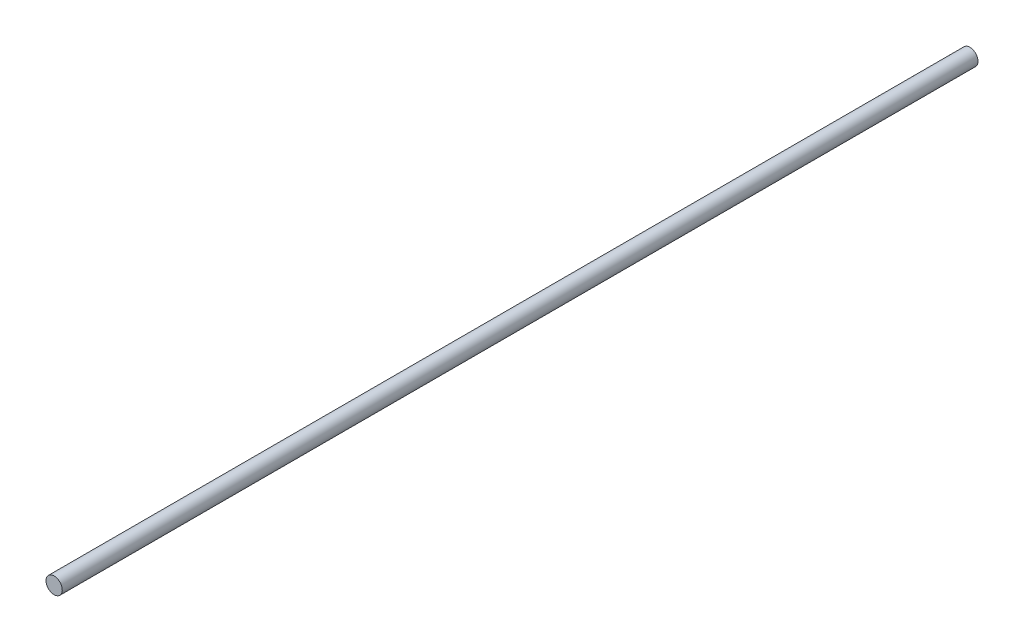
ISO-10303-21;
HEADER;
FILE_DESCRIPTION(('STEP AP214'),'2;1');
FILE_NAME('part.step','',(''),(''),'','','');
FILE_SCHEMA(('AUTOMOTIVE_DESIGN { 1 0 10303 214 1 1 1 1 }'));
ENDSEC;
DATA;
#1=APPLICATION_CONTEXT('core data for automotive mechanical design processes');
#2=APPLICATION_PROTOCOL_DEFINITION('international standard','automotive_design',2000,#1);
#3=PRODUCT_CONTEXT('',#1,'mechanical');
#4=PRODUCT('Part','Part','',(#3));
#5=PRODUCT_RELATED_PRODUCT_CATEGORY('part','',(#4));
#6=PRODUCT_DEFINITION_FORMATION('','',#4);
#7=PRODUCT_DEFINITION_CONTEXT('part definition',#1,'design');
#8=PRODUCT_DEFINITION('design','',#6,#7);
#9=PRODUCT_DEFINITION_SHAPE('','',#8);
#10=(LENGTH_UNIT() NAMED_UNIT(*) SI_UNIT(.MILLI.,.METRE.));
#11=(NAMED_UNIT(*) PLANE_ANGLE_UNIT() SI_UNIT($,.RADIAN.));
#12=(NAMED_UNIT(*) SI_UNIT($,.STERADIAN.) SOLID_ANGLE_UNIT());
#13=UNCERTAINTY_MEASURE_WITH_UNIT(LENGTH_MEASURE(1.E-05),#10,'distance_accuracy_value','');
#14=(GEOMETRIC_REPRESENTATION_CONTEXT(3) GLOBAL_UNCERTAINTY_ASSIGNED_CONTEXT((#13)) GLOBAL_UNIT_ASSIGNED_CONTEXT((#10,
#11,#12)) REPRESENTATION_CONTEXT('',''));
#15=CARTESIAN_POINT('',(0.,0.,0.));
#16=DIRECTION('',(0.,0.,1.));
#17=DIRECTION('',(1.,0.,0.));
#18=AXIS2_PLACEMENT_3D('',#15,#16,#17);
#19=CARTESIAN_POINT('',(0.,0.,450.));
#20=DIRECTION('',(0.,0.,-1.));
#21=DIRECTION('',(-1.,0.,0.));
#22=AXIS2_PLACEMENT_3D('',#19,#20,#21);
#23=CYLINDRICAL_SURFACE('',#22,4.);
#24=CARTESIAN_POINT('',(0.,0.,450.));
#25=DIRECTION('',(0.,0.,1.));
#26=DIRECTION('',(1.,0.,0.));
#27=AXIS2_PLACEMENT_3D('',#24,#25,#26);
#28=CIRCLE('',#27,4.);
#29=CARTESIAN_POINT('',(4.,0.,450.));
#30=VERTEX_POINT('',#29);
#31=EDGE_CURVE('E10',#30,#30,#28,.T.);
#32=ORIENTED_EDGE('',*,*,#31,.F.);
#33=EDGE_LOOP('',(#32));
#34=FACE_BOUND('',#33,.T.);
#35=CARTESIAN_POINT('',(0.,0.,0.));
#36=DIRECTION('',(0.,0.,1.));
#37=DIRECTION('',(1.,0.,0.));
#38=AXIS2_PLACEMENT_3D('',#35,#36,#37);
#39=CIRCLE('',#38,4.);
#40=CARTESIAN_POINT('',(4.,0.,0.));
#41=VERTEX_POINT('',#40);
#42=EDGE_CURVE('E37',#41,#41,#39,.T.);
#43=ORIENTED_EDGE('',*,*,#42,.T.);
#44=EDGE_LOOP('',(#43));
#45=FACE_BOUND('',#44,.T.);
#46=ADVANCED_FACE('F34',(#34,#45),#23,.T.);
#47=CARTESIAN_POINT('',(0.,0.,450.));
#48=DIRECTION('',(0.,0.,1.));
#49=DIRECTION('',(1.,0.,0.));
#50=AXIS2_PLACEMENT_3D('',#47,#48,#49);
#51=PLANE('',#50);
#52=ORIENTED_EDGE('',*,*,#31,.T.);
#53=EDGE_LOOP('',(#52));
#54=FACE_BOUND('',#53,.T.);
#55=ADVANCED_FACE('F49',(#54),#51,.T.);
#56=CARTESIAN_POINT('',(0.,0.,0.));
#57=DIRECTION('',(0.,0.,1.));
#58=DIRECTION('',(1.,0.,0.));
#59=AXIS2_PLACEMENT_3D('',#56,#57,#58);
#60=PLANE('',#59);
#61=ORIENTED_EDGE('',*,*,#42,.F.);
#62=EDGE_LOOP('',(#61));
#63=FACE_BOUND('',#62,.T.);
#64=ADVANCED_FACE('F47',(#63),#60,.F.);
#65=CLOSED_SHELL('',(#46,#55,#64));
#66=MANIFOLD_SOLID_BREP('B2',#65);
#67=ADVANCED_BREP_SHAPE_REPRESENTATION('',(#18,#66),#14);
#68=SHAPE_DEFINITION_REPRESENTATION(#9,#67);
ENDSEC;
END-ISO-10303-21;
